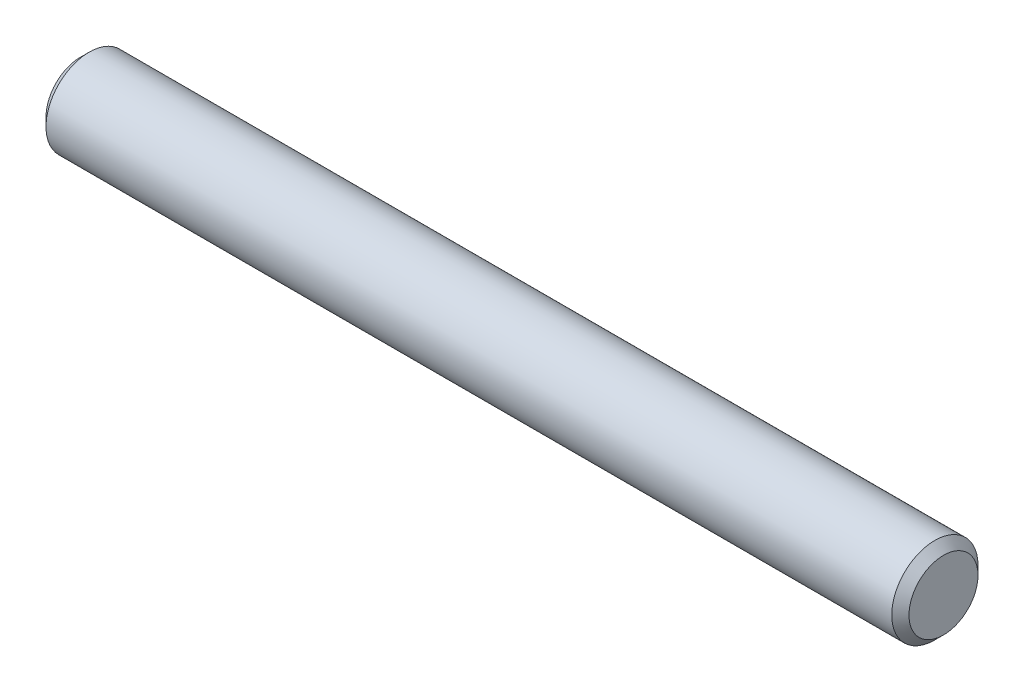
ISO-10303-21;
HEADER;
FILE_DESCRIPTION(('STEP AP214'),'2;1');
FILE_NAME('part.step','',(''),(''),'','','');
FILE_SCHEMA(('AUTOMOTIVE_DESIGN { 1 0 10303 214 1 1 1 1 }'));
ENDSEC;
DATA;
#1=APPLICATION_CONTEXT('core data for automotive mechanical design processes');
#2=APPLICATION_PROTOCOL_DEFINITION('international standard','automotive_design',2000,#1);
#3=PRODUCT_CONTEXT('',#1,'mechanical');
#4=PRODUCT('Part','Part','',(#3));
#5=PRODUCT_RELATED_PRODUCT_CATEGORY('part','',(#4));
#6=PRODUCT_DEFINITION_FORMATION('','',#4);
#7=PRODUCT_DEFINITION_CONTEXT('part definition',#1,'design');
#8=PRODUCT_DEFINITION('design','',#6,#7);
#9=PRODUCT_DEFINITION_SHAPE('','',#8);
#10=(LENGTH_UNIT() NAMED_UNIT(*) SI_UNIT(.MILLI.,.METRE.));
#11=(NAMED_UNIT(*) PLANE_ANGLE_UNIT() SI_UNIT($,.RADIAN.));
#12=(NAMED_UNIT(*) SI_UNIT($,.STERADIAN.) SOLID_ANGLE_UNIT());
#13=UNCERTAINTY_MEASURE_WITH_UNIT(LENGTH_MEASURE(1.E-05),#10,'distance_accuracy_value','');
#14=(GEOMETRIC_REPRESENTATION_CONTEXT(3) GLOBAL_UNCERTAINTY_ASSIGNED_CONTEXT((#13)) GLOBAL_UNIT_ASSIGNED_CONTEXT((#10,
#11,#12)) REPRESENTATION_CONTEXT('',''));
#15=CARTESIAN_POINT('',(0.,0.,0.));
#16=DIRECTION('',(0.,0.,1.));
#17=DIRECTION('',(1.,0.,0.));
#18=AXIS2_PLACEMENT_3D('',#15,#16,#17);
#19=CARTESIAN_POINT('',(-15.875,0.,0.));
#20=DIRECTION('',(1.,0.,0.));
#21=DIRECTION('',(0.,0.,-1.));
#22=AXIS2_PLACEMENT_3D('',#19,#20,#21);
#23=CYLINDRICAL_SURFACE('',#22,1.5875);
#24=CARTESIAN_POINT('',(15.5575,0.,0.));
#25=DIRECTION('',(1.,0.,0.));
#26=DIRECTION('',(0.,0.,-1.));
#27=AXIS2_PLACEMENT_3D('',#24,#25,#26);
#28=CIRCLE('',#27,1.5875);
#29=CARTESIAN_POINT('',(15.5575,0.,-1.5875));
#30=VERTEX_POINT('',#29);
#31=EDGE_CURVE('E43',#30,#30,#28,.F.);
#32=ORIENTED_EDGE('',*,*,#31,.T.);
#33=EDGE_LOOP('',(#32));
#34=FACE_BOUND('',#33,.T.);
#35=CARTESIAN_POINT('',(-15.5575,0.,0.));
#36=DIRECTION('',(1.,0.,0.));
#37=DIRECTION('',(0.,0.,-1.));
#38=AXIS2_PLACEMENT_3D('',#35,#36,#37);
#39=CIRCLE('',#38,1.5875);
#40=CARTESIAN_POINT('',(-15.5575,0.,-1.5875));
#41=VERTEX_POINT('',#40);
#42=EDGE_CURVE('E49',#41,#41,#39,.T.);
#43=ORIENTED_EDGE('',*,*,#42,.T.);
#44=EDGE_LOOP('',(#43));
#45=FACE_BOUND('',#44,.T.);
#46=ADVANCED_FACE('F35',(#34,#45),#23,.T.);
#47=CARTESIAN_POINT('',(-15.875,0.,0.));
#48=DIRECTION('',(1.,0.,0.));
#49=DIRECTION('',(0.,0.,-1.));
#50=AXIS2_PLACEMENT_3D('',#47,#48,#49);
#51=PLANE('',#50);
#52=CARTESIAN_POINT('',(-15.875,0.,0.));
#53=DIRECTION('',(1.,0.,0.));
#54=DIRECTION('',(0.,0.,-1.));
#55=AXIS2_PLACEMENT_3D('',#52,#53,#54);
#56=CIRCLE('',#55,1.27);
#57=CARTESIAN_POINT('',(-15.875,0.,-1.27));
#58=VERTEX_POINT('',#57);
#59=EDGE_CURVE('E10',#58,#58,#56,.F.);
#60=ORIENTED_EDGE('',*,*,#59,.T.);
#61=EDGE_LOOP('',(#60));
#62=FACE_BOUND('',#61,.T.);
#63=ADVANCED_FACE('F70',(#62),#51,.F.);
#64=CARTESIAN_POINT('',(15.875,0.,0.));
#65=DIRECTION('',(1.,0.,0.));
#66=DIRECTION('',(0.,0.,-1.));
#67=AXIS2_PLACEMENT_3D('',#64,#65,#66);
#68=PLANE('',#67);
#69=CARTESIAN_POINT('',(15.875,0.,0.));
#70=DIRECTION('',(1.,0.,0.));
#71=DIRECTION('',(0.,0.,-1.));
#72=AXIS2_PLACEMENT_3D('',#69,#70,#71);
#73=CIRCLE('',#72,1.27);
#74=CARTESIAN_POINT('',(15.875,0.,-1.27));
#75=VERTEX_POINT('',#74);
#76=EDGE_CURVE('E54',#75,#75,#73,.T.);
#77=ORIENTED_EDGE('',*,*,#76,.T.);
#78=EDGE_LOOP('',(#77));
#79=FACE_BOUND('',#78,.T.);
#80=ADVANCED_FACE('F60',(#79),#68,.T.);
#81=CARTESIAN_POINT('',(15.875,0.,0.));
#82=DIRECTION('',(-1.,0.,0.));
#83=DIRECTION('',(0.,0.,1.));
#84=AXIS2_PLACEMENT_3D('',#81,#82,#83);
#85=CONICAL_SURFACE('',#84,1.27,0.785398163397445);
#86=ORIENTED_EDGE('',*,*,#31,.F.);
#87=EDGE_LOOP('',(#86));
#88=FACE_BOUND('',#87,.T.);
#89=ORIENTED_EDGE('',*,*,#76,.F.);
#90=EDGE_LOOP('',(#89));
#91=FACE_BOUND('',#90,.T.);
#92=ADVANCED_FACE('F62',(#88,#91),#85,.T.);
#93=CARTESIAN_POINT('',(-15.5575,0.,0.));
#94=DIRECTION('',(1.,0.,0.));
#95=DIRECTION('',(0.,0.,-1.));
#96=AXIS2_PLACEMENT_3D('',#93,#94,#95);
#97=CONICAL_SURFACE('',#96,1.5875,0.78539816339745);
#98=ORIENTED_EDGE('',*,*,#59,.F.);
#99=EDGE_LOOP('',(#98));
#100=FACE_BOUND('',#99,.T.);
#101=ORIENTED_EDGE('',*,*,#42,.F.);
#102=EDGE_LOOP('',(#101));
#103=FACE_BOUND('',#102,.T.);
#104=ADVANCED_FACE('F37',(#100,#103),#97,.T.);
#105=CLOSED_SHELL('',(#46,#63,#80,#92,#104));
#106=MANIFOLD_SOLID_BREP('B2',#105);
#107=ADVANCED_BREP_SHAPE_REPRESENTATION('',(#18,#106),#14);
#108=SHAPE_DEFINITION_REPRESENTATION(#9,#107);
ENDSEC;
END-ISO-10303-21;
